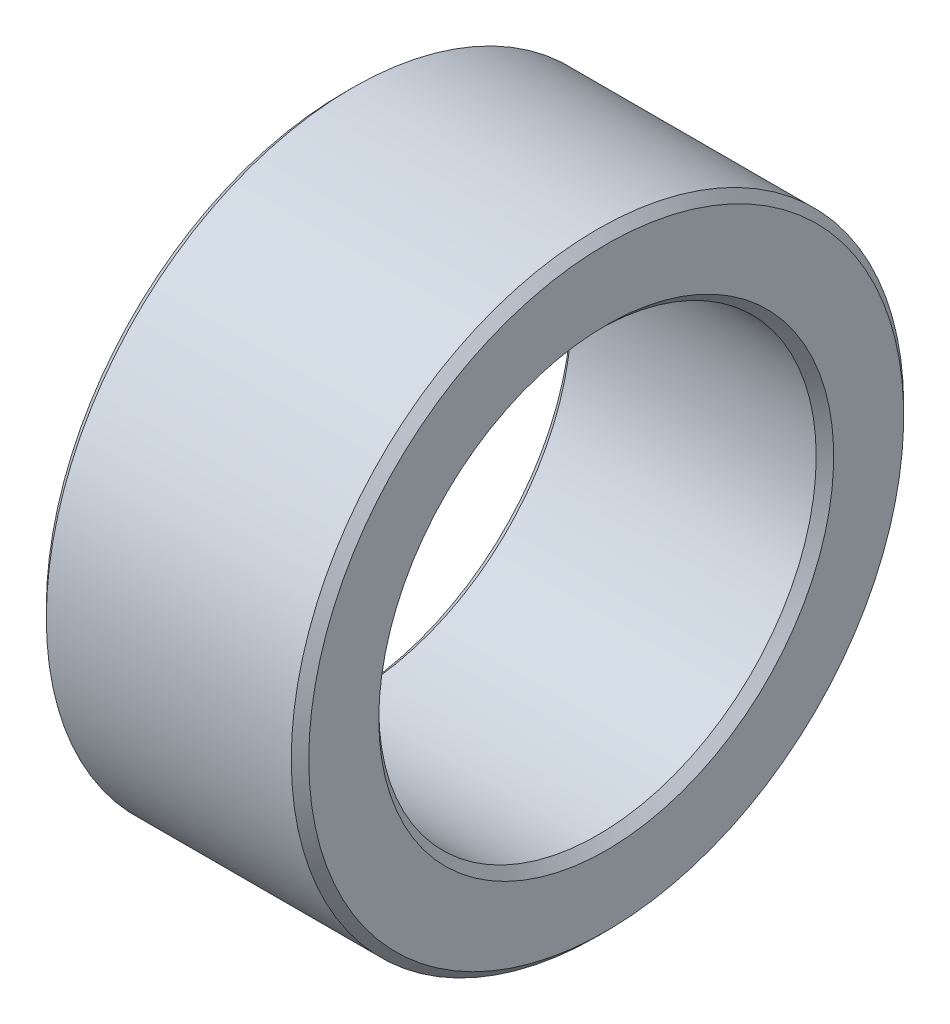
ISO-10303-21;
HEADER;
FILE_DESCRIPTION(('STEP AP214'),'2;1');
FILE_NAME('part.step','',(''),(''),'','','');
FILE_SCHEMA(('AUTOMOTIVE_DESIGN { 1 0 10303 214 1 1 1 1 }'));
ENDSEC;
DATA;
#1=APPLICATION_CONTEXT('core data for automotive mechanical design processes');
#2=APPLICATION_PROTOCOL_DEFINITION('international standard','automotive_design',2000,#1);
#3=PRODUCT_CONTEXT('',#1,'mechanical');
#4=PRODUCT('Part','Part','',(#3));
#5=PRODUCT_RELATED_PRODUCT_CATEGORY('part','',(#4));
#6=PRODUCT_DEFINITION_FORMATION('','',#4);
#7=PRODUCT_DEFINITION_CONTEXT('part definition',#1,'design');
#8=PRODUCT_DEFINITION('design','',#6,#7);
#9=PRODUCT_DEFINITION_SHAPE('','',#8);
#10=(LENGTH_UNIT() NAMED_UNIT(*) SI_UNIT(.MILLI.,.METRE.));
#11=(NAMED_UNIT(*) PLANE_ANGLE_UNIT() SI_UNIT($,.RADIAN.));
#12=(NAMED_UNIT(*) SI_UNIT($,.STERADIAN.) SOLID_ANGLE_UNIT());
#13=UNCERTAINTY_MEASURE_WITH_UNIT(LENGTH_MEASURE(1.E-05),#10,'distance_accuracy_value','');
#14=(GEOMETRIC_REPRESENTATION_CONTEXT(3) GLOBAL_UNCERTAINTY_ASSIGNED_CONTEXT((#13)) GLOBAL_UNIT_ASSIGNED_CONTEXT((#10,
#11,#12)) REPRESENTATION_CONTEXT('',''));
#15=CARTESIAN_POINT('',(0.,0.,0.));
#16=DIRECTION('',(0.,0.,1.));
#17=DIRECTION('',(1.,0.,0.));
#18=AXIS2_PLACEMENT_3D('',#15,#16,#17);
#19=CARTESIAN_POINT('',(0.,0.,0.));
#20=DIRECTION('',(-1.,0.,0.));
#21=DIRECTION('',(0.,0.,1.));
#22=AXIS2_PLACEMENT_3D('',#19,#20,#21);
#23=CONICAL_SURFACE('',#22,5.2,0.785398163397448);
#24=CARTESIAN_POINT('',(0.2,0.,0.));
#25=DIRECTION('',(-1.,0.,0.));
#26=DIRECTION('',(0.,0.,1.));
#27=AXIS2_PLACEMENT_3D('',#24,#25,#26);
#28=CIRCLE('',#27,5.);
#29=CARTESIAN_POINT('',(0.2,0.,5.));
#30=VERTEX_POINT('',#29);
#31=EDGE_CURVE('E10',#30,#30,#28,.T.);
#32=ORIENTED_EDGE('',*,*,#31,.F.);
#33=EDGE_LOOP('',(#32));
#34=FACE_BOUND('',#33,.T.);
#35=CARTESIAN_POINT('',(0.,0.,0.));
#36=DIRECTION('',(-1.,0.,0.));
#37=DIRECTION('',(0.,0.,1.));
#38=AXIS2_PLACEMENT_3D('',#35,#36,#37);
#39=CIRCLE('',#38,5.2);
#40=CARTESIAN_POINT('',(0.,0.,5.2));
#41=VERTEX_POINT('',#40);
#42=EDGE_CURVE('E61',#41,#41,#39,.T.);
#43=ORIENTED_EDGE('',*,*,#42,.T.);
#44=EDGE_LOOP('',(#43));
#45=FACE_BOUND('',#44,.T.);
#46=ADVANCED_FACE('F33',(#34,#45),#23,.F.);
#47=CARTESIAN_POINT('',(0.,0.,0.));
#48=DIRECTION('',(-1.,0.,0.));
#49=DIRECTION('',(0.,0.,1.));
#50=AXIS2_PLACEMENT_3D('',#47,#48,#49);
#51=CYLINDRICAL_SURFACE('',#50,5.);
#52=CARTESIAN_POINT('',(5.8,0.,0.));
#53=DIRECTION('',(-1.,0.,0.));
#54=DIRECTION('',(0.,0.,1.));
#55=AXIS2_PLACEMENT_3D('',#52,#53,#54);
#56=CIRCLE('',#55,5.);
#57=CARTESIAN_POINT('',(5.8,0.,5.));
#58=VERTEX_POINT('',#57);
#59=EDGE_CURVE('E39',#58,#58,#56,.T.);
#60=ORIENTED_EDGE('',*,*,#59,.F.);
#61=EDGE_LOOP('',(#60));
#62=FACE_BOUND('',#61,.T.);
#63=ORIENTED_EDGE('',*,*,#31,.T.);
#64=EDGE_LOOP('',(#63));
#65=FACE_BOUND('',#64,.T.);
#66=ADVANCED_FACE('F98',(#62,#65),#51,.F.);
#67=CARTESIAN_POINT('',(5.8,0.,0.));
#68=DIRECTION('',(1.,0.,0.));
#69=DIRECTION('',(0.,0.,-1.));
#70=AXIS2_PLACEMENT_3D('',#67,#68,#69);
#71=CONICAL_SURFACE('',#70,5.,0.785398163397448);
#72=CARTESIAN_POINT('',(6.,0.,0.));
#73=DIRECTION('',(-1.,0.,0.));
#74=DIRECTION('',(0.,0.,1.));
#75=AXIS2_PLACEMENT_3D('',#72,#73,#74);
#76=CIRCLE('',#75,5.2);
#77=CARTESIAN_POINT('',(6.,0.,5.2));
#78=VERTEX_POINT('',#77);
#79=EDGE_CURVE('E43',#78,#78,#76,.T.);
#80=ORIENTED_EDGE('',*,*,#79,.F.);
#81=EDGE_LOOP('',(#80));
#82=FACE_BOUND('',#81,.T.);
#83=ORIENTED_EDGE('',*,*,#59,.T.);
#84=EDGE_LOOP('',(#83));
#85=FACE_BOUND('',#84,.T.);
#86=ADVANCED_FACE('F93',(#82,#85),#71,.F.);
#87=CARTESIAN_POINT('',(6.,5.2,0.));
#88=DIRECTION('',(-1.,0.,0.));
#89=DIRECTION('',(0.,0.,1.));
#90=AXIS2_PLACEMENT_3D('',#87,#88,#89);
#91=PLANE('',#90);
#92=CARTESIAN_POINT('',(6.,0.,0.));
#93=DIRECTION('',(-1.,0.,0.));
#94=DIRECTION('',(0.,0.,1.));
#95=AXIS2_PLACEMENT_3D('',#92,#93,#94);
#96=CIRCLE('',#95,6.8);
#97=CARTESIAN_POINT('',(6.,0.,6.8));
#98=VERTEX_POINT('',#97);
#99=EDGE_CURVE('E47',#98,#98,#96,.T.);
#100=ORIENTED_EDGE('',*,*,#99,.F.);
#101=EDGE_LOOP('',(#100));
#102=FACE_BOUND('',#101,.T.);
#103=ORIENTED_EDGE('',*,*,#79,.T.);
#104=EDGE_LOOP('',(#103));
#105=FACE_BOUND('',#104,.T.);
#106=ADVANCED_FACE('F87',(#102,#105),#91,.F.);
#107=CARTESIAN_POINT('',(6.,0.,0.));
#108=DIRECTION('',(-1.,0.,0.));
#109=DIRECTION('',(0.,0.,1.));
#110=AXIS2_PLACEMENT_3D('',#107,#108,#109);
#111=CONICAL_SURFACE('',#110,6.8,0.785398163397448);
#112=CARTESIAN_POINT('',(5.8,0.,0.));
#113=DIRECTION('',(-1.,0.,0.));
#114=DIRECTION('',(0.,0.,1.));
#115=AXIS2_PLACEMENT_3D('',#112,#113,#114);
#116=CIRCLE('',#115,7.);
#117=CARTESIAN_POINT('',(5.8,0.,7.));
#118=VERTEX_POINT('',#117);
#119=EDGE_CURVE('E52',#118,#118,#116,.T.);
#120=ORIENTED_EDGE('',*,*,#119,.F.);
#121=EDGE_LOOP('',(#120));
#122=FACE_BOUND('',#121,.T.);
#123=ORIENTED_EDGE('',*,*,#99,.T.);
#124=EDGE_LOOP('',(#123));
#125=FACE_BOUND('',#124,.T.);
#126=ADVANCED_FACE('F81',(#122,#125),#111,.T.);
#127=CARTESIAN_POINT('',(0.,0.,0.));
#128=DIRECTION('',(-1.,0.,0.));
#129=DIRECTION('',(0.,0.,1.));
#130=AXIS2_PLACEMENT_3D('',#127,#128,#129);
#131=CYLINDRICAL_SURFACE('',#130,7.);
#132=CARTESIAN_POINT('',(0.2,0.,0.));
#133=DIRECTION('',(-1.,0.,0.));
#134=DIRECTION('',(0.,0.,1.));
#135=AXIS2_PLACEMENT_3D('',#132,#133,#134);
#136=CIRCLE('',#135,7.);
#137=CARTESIAN_POINT('',(0.2,0.,7.));
#138=VERTEX_POINT('',#137);
#139=EDGE_CURVE('E55',#138,#138,#136,.T.);
#140=ORIENTED_EDGE('',*,*,#139,.F.);
#141=EDGE_LOOP('',(#140));
#142=FACE_BOUND('',#141,.T.);
#143=ORIENTED_EDGE('',*,*,#119,.T.);
#144=EDGE_LOOP('',(#143));
#145=FACE_BOUND('',#144,.T.);
#146=ADVANCED_FACE('F75',(#142,#145),#131,.T.);
#147=CARTESIAN_POINT('',(0.2,0.,0.));
#148=DIRECTION('',(1.,0.,0.));
#149=DIRECTION('',(0.,0.,-1.));
#150=AXIS2_PLACEMENT_3D('',#147,#148,#149);
#151=CONICAL_SURFACE('',#150,7.,0.785398163397447);
#152=CARTESIAN_POINT('',(0.,0.,0.));
#153=DIRECTION('',(-1.,0.,0.));
#154=DIRECTION('',(0.,0.,1.));
#155=AXIS2_PLACEMENT_3D('',#152,#153,#154);
#156=CIRCLE('',#155,6.8);
#157=CARTESIAN_POINT('',(0.,0.,6.8));
#158=VERTEX_POINT('',#157);
#159=EDGE_CURVE('E58',#158,#158,#156,.T.);
#160=ORIENTED_EDGE('',*,*,#159,.F.);
#161=EDGE_LOOP('',(#160));
#162=FACE_BOUND('',#161,.T.);
#163=ORIENTED_EDGE('',*,*,#139,.T.);
#164=EDGE_LOOP('',(#163));
#165=FACE_BOUND('',#164,.T.);
#166=ADVANCED_FACE('F69',(#162,#165),#151,.T.);
#167=CARTESIAN_POINT('',(0.,6.8,0.));
#168=DIRECTION('',(1.,0.,0.));
#169=DIRECTION('',(0.,0.,-1.));
#170=AXIS2_PLACEMENT_3D('',#167,#168,#169);
#171=PLANE('',#170);
#172=ORIENTED_EDGE('',*,*,#42,.F.);
#173=EDGE_LOOP('',(#172));
#174=FACE_BOUND('',#173,.T.);
#175=ORIENTED_EDGE('',*,*,#159,.T.);
#176=EDGE_LOOP('',(#175));
#177=FACE_BOUND('',#176,.T.);
#178=ADVANCED_FACE('F66',(#174,#177),#171,.F.);
#179=CLOSED_SHELL('',(#46,#66,#86,#106,#126,#146,#166,#178));
#180=MANIFOLD_SOLID_BREP('B2',#179);
#181=ADVANCED_BREP_SHAPE_REPRESENTATION('',(#18,#180),#14);
#182=SHAPE_DEFINITION_REPRESENTATION(#9,#181);
ENDSEC;
END-ISO-10303-21;
